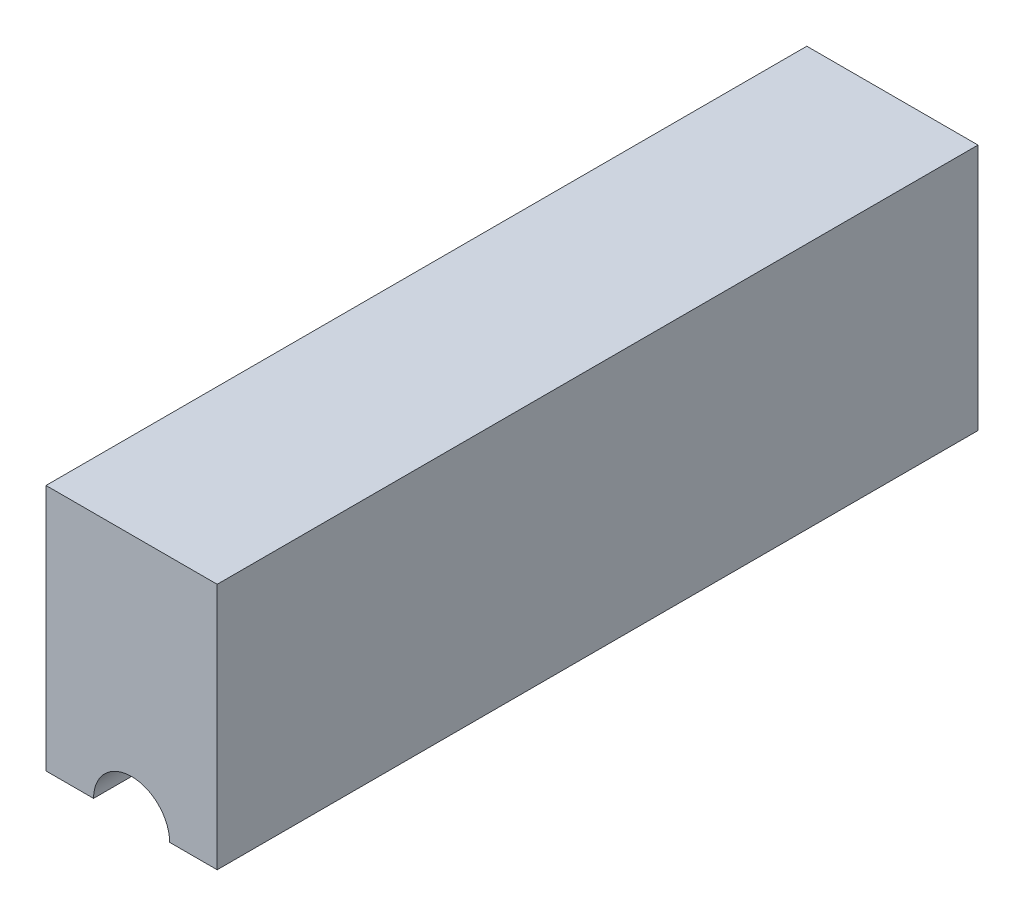
ISO-10303-21;
HEADER;
FILE_DESCRIPTION(('STEP AP214'),'2;1');
FILE_NAME('part.step','',(''),(''),'','','');
FILE_SCHEMA(('AUTOMOTIVE_DESIGN { 1 0 10303 214 1 1 1 1 }'));
ENDSEC;
DATA;
#1=APPLICATION_CONTEXT('core data for automotive mechanical design processes');
#2=APPLICATION_PROTOCOL_DEFINITION('international standard','automotive_design',2000,#1);
#3=PRODUCT_CONTEXT('',#1,'mechanical');
#4=PRODUCT('Part','Part','',(#3));
#5=PRODUCT_RELATED_PRODUCT_CATEGORY('part','',(#4));
#6=PRODUCT_DEFINITION_FORMATION('','',#4);
#7=PRODUCT_DEFINITION_CONTEXT('part definition',#1,'design');
#8=PRODUCT_DEFINITION('design','',#6,#7);
#9=PRODUCT_DEFINITION_SHAPE('','',#8);
#10=(LENGTH_UNIT() NAMED_UNIT(*) SI_UNIT(.MILLI.,.METRE.));
#11=(NAMED_UNIT(*) PLANE_ANGLE_UNIT() SI_UNIT($,.RADIAN.));
#12=(NAMED_UNIT(*) SI_UNIT($,.STERADIAN.) SOLID_ANGLE_UNIT());
#13=UNCERTAINTY_MEASURE_WITH_UNIT(LENGTH_MEASURE(1.E-05),#10,'distance_accuracy_value','');
#14=(GEOMETRIC_REPRESENTATION_CONTEXT(3) GLOBAL_UNCERTAINTY_ASSIGNED_CONTEXT((#13)) GLOBAL_UNIT_ASSIGNED_CONTEXT((#10,
#11,#12)) REPRESENTATION_CONTEXT('',''));
#15=CARTESIAN_POINT('',(0.,0.,0.));
#16=DIRECTION('',(0.,0.,1.));
#17=DIRECTION('',(1.,0.,0.));
#18=AXIS2_PLACEMENT_3D('',#15,#16,#17);
#19=CARTESIAN_POINT('',(0.,0.,100.));
#20=DIRECTION('',(1.,0.,0.));
#21=DIRECTION('',(0.,0.,-1.));
#22=AXIS2_PLACEMENT_3D('',#19,#20,#21);
#23=PLANE('',#22);
#24=DIRECTION('',(0.,-1.,0.));
#25=VECTOR('',#24,1.);
#26=CARTESIAN_POINT('',(0.,0.,-100.));
#27=LINE('',#26,#25);
#28=CARTESIAN_POINT('',(0.,65.,-100.));
#29=VERTEX_POINT('',#28);
#30=CARTESIAN_POINT('',(0.,0.,-100.));
#31=VERTEX_POINT('',#30);
#32=EDGE_CURVE('E90',#29,#31,#27,.T.);
#33=ORIENTED_EDGE('',*,*,#32,.T.);
#34=DIRECTION('',(0.,0.,-1.));
#35=VECTOR('',#34,1.);
#36=CARTESIAN_POINT('',(0.,0.,100.));
#37=LINE('',#36,#35);
#38=CARTESIAN_POINT('',(0.,0.,100.));
#39=VERTEX_POINT('',#38);
#40=EDGE_CURVE('E11',#39,#31,#37,.T.);
#41=ORIENTED_EDGE('',*,*,#40,.F.);
#42=DIRECTION('',(0.,-1.,0.));
#43=VECTOR('',#42,1.);
#44=CARTESIAN_POINT('',(0.,0.,100.));
#45=LINE('',#44,#43);
#46=CARTESIAN_POINT('',(0.,65.,100.));
#47=VERTEX_POINT('',#46);
#48=EDGE_CURVE('E113',#47,#39,#45,.T.);
#49=ORIENTED_EDGE('',*,*,#48,.F.);
#50=DIRECTION('',(0.,0.,-1.));
#51=VECTOR('',#50,1.);
#52=CARTESIAN_POINT('',(0.,65.,100.));
#53=LINE('',#52,#51);
#54=EDGE_CURVE('E103',#47,#29,#53,.T.);
#55=ORIENTED_EDGE('',*,*,#54,.T.);
#56=EDGE_LOOP('',(#33,#41,#49,#55));
#57=FACE_BOUND('',#56,.T.);
#58=ADVANCED_FACE('F34',(#57),#23,.F.);
#59=CARTESIAN_POINT('',(0.,0.,100.));
#60=DIRECTION('',(0.,1.,0.));
#61=DIRECTION('',(0.,0.,1.));
#62=AXIS2_PLACEMENT_3D('',#59,#60,#61);
#63=PLANE('',#62);
#64=DIRECTION('',(1.,0.,0.));
#65=VECTOR('',#64,1.);
#66=CARTESIAN_POINT('',(0.,0.,-100.));
#67=LINE('',#66,#65);
#68=CARTESIAN_POINT('',(12.5,0.,-100.));
#69=VERTEX_POINT('',#68);
#70=EDGE_CURVE('E86',#31,#69,#67,.T.);
#71=ORIENTED_EDGE('',*,*,#70,.T.);
#72=DIRECTION('',(0.,0.,-1.));
#73=VECTOR('',#72,1.);
#74=CARTESIAN_POINT('',(12.5,0.,100.));
#75=LINE('',#74,#73);
#76=CARTESIAN_POINT('',(12.5,0.,100.));
#77=VERTEX_POINT('',#76);
#78=EDGE_CURVE('E41',#77,#69,#75,.T.);
#79=ORIENTED_EDGE('',*,*,#78,.F.);
#80=DIRECTION('',(1.,0.,0.));
#81=VECTOR('',#80,1.);
#82=CARTESIAN_POINT('',(0.,0.,100.));
#83=LINE('',#82,#81);
#84=EDGE_CURVE('E99',#39,#77,#83,.T.);
#85=ORIENTED_EDGE('',*,*,#84,.F.);
#86=ORIENTED_EDGE('',*,*,#40,.T.);
#87=EDGE_LOOP('',(#71,#79,#85,#86));
#88=FACE_BOUND('',#87,.T.);
#89=ADVANCED_FACE('F98',(#88),#63,.F.);
#90=CARTESIAN_POINT('',(22.5,0.,100.));
#91=DIRECTION('',(0.,0.,-1.));
#92=DIRECTION('',(-1.,0.,0.));
#93=AXIS2_PLACEMENT_3D('',#90,#91,#92);
#94=CYLINDRICAL_SURFACE('',#93,10.);
#95=CARTESIAN_POINT('',(22.5,0.,-100.));
#96=DIRECTION('',(0.,0.,-1.));
#97=DIRECTION('',(1.,0.,0.));
#98=AXIS2_PLACEMENT_3D('',#95,#96,#97);
#99=CIRCLE('',#98,10.);
#100=CARTESIAN_POINT('',(32.5,0.,-100.));
#101=VERTEX_POINT('',#100);
#102=EDGE_CURVE('E92',#69,#101,#99,.T.);
#103=ORIENTED_EDGE('',*,*,#102,.T.);
#104=DIRECTION('',(0.,0.,-1.));
#105=VECTOR('',#104,1.);
#106=CARTESIAN_POINT('',(32.5,0.,100.));
#107=LINE('',#106,#105);
#108=CARTESIAN_POINT('',(32.5,0.,100.));
#109=VERTEX_POINT('',#108);
#110=EDGE_CURVE('E129',#109,#101,#107,.T.);
#111=ORIENTED_EDGE('',*,*,#110,.F.);
#112=CARTESIAN_POINT('',(22.5,0.,100.));
#113=DIRECTION('',(0.,0.,-1.));
#114=DIRECTION('',(1.,0.,0.));
#115=AXIS2_PLACEMENT_3D('',#112,#113,#114);
#116=CIRCLE('',#115,10.);
#117=EDGE_CURVE('E116',#77,#109,#116,.T.);
#118=ORIENTED_EDGE('',*,*,#117,.F.);
#119=ORIENTED_EDGE('',*,*,#78,.T.);
#120=EDGE_LOOP('',(#103,#111,#118,#119));
#121=FACE_BOUND('',#120,.T.);
#122=ADVANCED_FACE('F133',(#121),#94,.F.);
#123=CARTESIAN_POINT('',(32.5,0.,100.));
#124=DIRECTION('',(0.,1.,0.));
#125=DIRECTION('',(0.,0.,1.));
#126=AXIS2_PLACEMENT_3D('',#123,#124,#125);
#127=PLANE('',#126);
#128=DIRECTION('',(1.,0.,0.));
#129=VECTOR('',#128,1.);
#130=CARTESIAN_POINT('',(32.5,0.,-100.));
#131=LINE('',#130,#129);
#132=CARTESIAN_POINT('',(45.,0.,-100.));
#133=VERTEX_POINT('',#132);
#134=EDGE_CURVE('E107',#101,#133,#131,.T.);
#135=ORIENTED_EDGE('',*,*,#134,.T.);
#136=DIRECTION('',(0.,0.,-1.));
#137=VECTOR('',#136,1.);
#138=CARTESIAN_POINT('',(45.,0.,100.));
#139=LINE('',#138,#137);
#140=CARTESIAN_POINT('',(45.,0.,100.));
#141=VERTEX_POINT('',#140);
#142=EDGE_CURVE('E126',#141,#133,#139,.T.);
#143=ORIENTED_EDGE('',*,*,#142,.F.);
#144=DIRECTION('',(1.,0.,0.));
#145=VECTOR('',#144,1.);
#146=CARTESIAN_POINT('',(32.5,0.,100.));
#147=LINE('',#146,#145);
#148=EDGE_CURVE('E118',#109,#141,#147,.T.);
#149=ORIENTED_EDGE('',*,*,#148,.F.);
#150=ORIENTED_EDGE('',*,*,#110,.T.);
#151=EDGE_LOOP('',(#135,#143,#149,#150));
#152=FACE_BOUND('',#151,.T.);
#153=ADVANCED_FACE('F139',(#152),#127,.F.);
#154=CARTESIAN_POINT('',(45.,0.,100.));
#155=DIRECTION('',(-1.,0.,0.));
#156=DIRECTION('',(0.,0.,1.));
#157=AXIS2_PLACEMENT_3D('',#154,#155,#156);
#158=PLANE('',#157);
#159=DIRECTION('',(0.,1.,0.));
#160=VECTOR('',#159,1.);
#161=CARTESIAN_POINT('',(45.,0.,-100.));
#162=LINE('',#161,#160);
#163=CARTESIAN_POINT('',(45.,65.,-100.));
#164=VERTEX_POINT('',#163);
#165=EDGE_CURVE('E109',#133,#164,#162,.T.);
#166=ORIENTED_EDGE('',*,*,#165,.T.);
#167=DIRECTION('',(0.,0.,-1.));
#168=VECTOR('',#167,1.);
#169=CARTESIAN_POINT('',(45.,65.,100.));
#170=LINE('',#169,#168);
#171=CARTESIAN_POINT('',(45.,65.,100.));
#172=VERTEX_POINT('',#171);
#173=EDGE_CURVE('E123',#172,#164,#170,.T.);
#174=ORIENTED_EDGE('',*,*,#173,.F.);
#175=DIRECTION('',(0.,1.,0.));
#176=VECTOR('',#175,1.);
#177=CARTESIAN_POINT('',(45.,0.,100.));
#178=LINE('',#177,#176);
#179=EDGE_CURVE('E53',#141,#172,#178,.T.);
#180=ORIENTED_EDGE('',*,*,#179,.F.);
#181=ORIENTED_EDGE('',*,*,#142,.T.);
#182=EDGE_LOOP('',(#166,#174,#180,#181));
#183=FACE_BOUND('',#182,.T.);
#184=ADVANCED_FACE('F142',(#183),#158,.F.);
#185=CARTESIAN_POINT('',(0.,65.,100.));
#186=DIRECTION('',(0.,-1.,0.));
#187=DIRECTION('',(0.,0.,-1.));
#188=AXIS2_PLACEMENT_3D('',#185,#186,#187);
#189=PLANE('',#188);
#190=DIRECTION('',(-1.,0.,0.));
#191=VECTOR('',#190,1.);
#192=CARTESIAN_POINT('',(0.,65.,-100.));
#193=LINE('',#192,#191);
#194=EDGE_CURVE('E111',#164,#29,#193,.T.);
#195=ORIENTED_EDGE('',*,*,#194,.T.);
#196=ORIENTED_EDGE('',*,*,#54,.F.);
#197=DIRECTION('',(-1.,0.,0.));
#198=VECTOR('',#197,1.);
#199=CARTESIAN_POINT('',(0.,65.,100.));
#200=LINE('',#199,#198);
#201=EDGE_CURVE('E48',#172,#47,#200,.T.);
#202=ORIENTED_EDGE('',*,*,#201,.F.);
#203=ORIENTED_EDGE('',*,*,#173,.T.);
#204=EDGE_LOOP('',(#195,#196,#202,#203));
#205=FACE_BOUND('',#204,.T.);
#206=ADVANCED_FACE('F144',(#205),#189,.F.);
#207=CARTESIAN_POINT('',(22.5,0.,100.));
#208=DIRECTION('',(0.,0.,1.));
#209=DIRECTION('',(1.,0.,0.));
#210=AXIS2_PLACEMENT_3D('',#207,#208,#209);
#211=PLANE('',#210);
#212=ORIENTED_EDGE('',*,*,#48,.T.);
#213=ORIENTED_EDGE('',*,*,#84,.T.);
#214=ORIENTED_EDGE('',*,*,#117,.T.);
#215=ORIENTED_EDGE('',*,*,#148,.T.);
#216=ORIENTED_EDGE('',*,*,#179,.T.);
#217=ORIENTED_EDGE('',*,*,#201,.T.);
#218=EDGE_LOOP('',(#212,#213,#214,#215,#216,#217));
#219=FACE_BOUND('',#218,.T.);
#220=ADVANCED_FACE('F136',(#219),#211,.T.);
#221=CARTESIAN_POINT('',(22.5,0.,-100.));
#222=DIRECTION('',(0.,0.,1.));
#223=DIRECTION('',(1.,0.,0.));
#224=AXIS2_PLACEMENT_3D('',#221,#222,#223);
#225=PLANE('',#224);
#226=ORIENTED_EDGE('',*,*,#32,.F.);
#227=ORIENTED_EDGE('',*,*,#194,.F.);
#228=ORIENTED_EDGE('',*,*,#165,.F.);
#229=ORIENTED_EDGE('',*,*,#134,.F.);
#230=ORIENTED_EDGE('',*,*,#102,.F.);
#231=ORIENTED_EDGE('',*,*,#70,.F.);
#232=EDGE_LOOP('',(#226,#227,#228,#229,#230,#231));
#233=FACE_BOUND('',#232,.T.);
#234=ADVANCED_FACE('F87',(#233),#225,.F.);
#235=CLOSED_SHELL('',(#58,#89,#122,#153,#184,#206,#220,#234));
#236=MANIFOLD_SOLID_BREP('B2',#235);
#237=ADVANCED_BREP_SHAPE_REPRESENTATION('',(#18,#236),#14);
#238=SHAPE_DEFINITION_REPRESENTATION(#9,#237);
ENDSEC;
END-ISO-10303-21;
